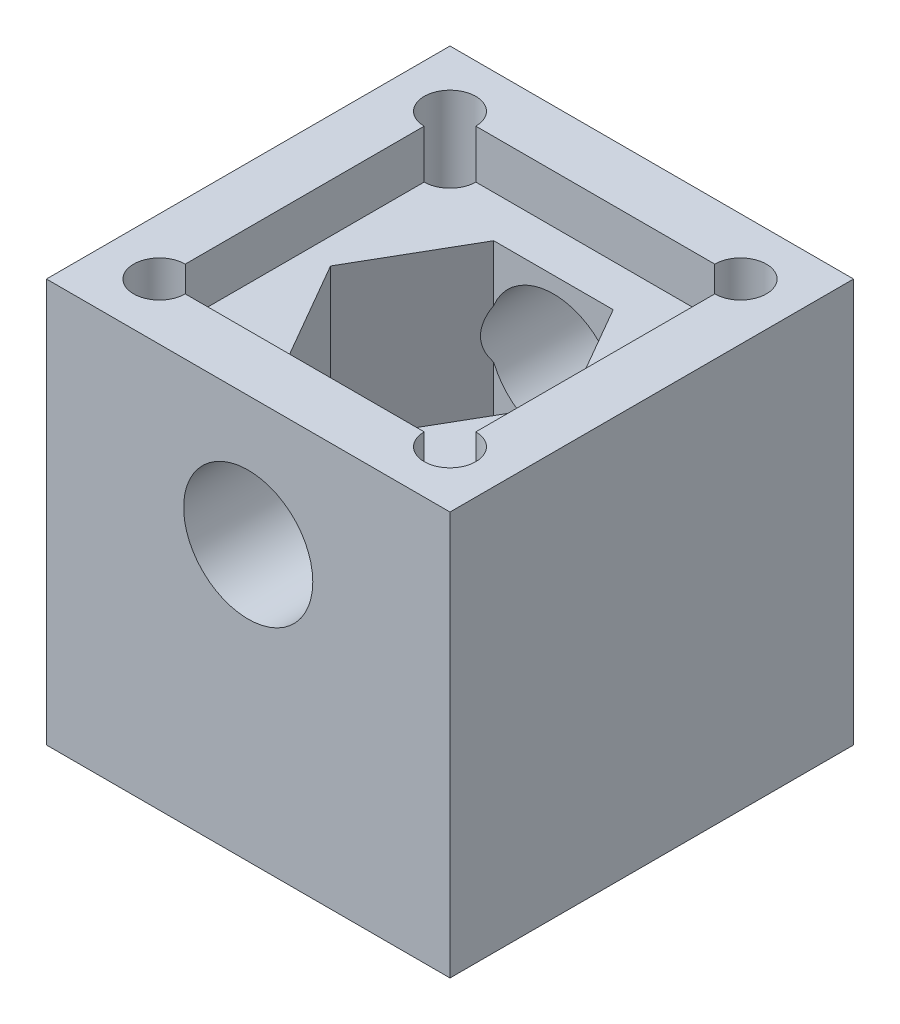
ISO-10303-21;
HEADER;
FILE_DESCRIPTION(('STEP AP214'),'2;1');
FILE_NAME('part.step','',(''),(''),'','','');
FILE_SCHEMA(('AUTOMOTIVE_DESIGN { 1 0 10303 214 1 1 1 1 }'));
ENDSEC;
DATA;
#1=APPLICATION_CONTEXT('core data for automotive mechanical design processes');
#2=APPLICATION_PROTOCOL_DEFINITION('international standard','automotive_design',2000,#1);
#3=PRODUCT_CONTEXT('',#1,'mechanical');
#4=PRODUCT('Part','Part','',(#3));
#5=PRODUCT_RELATED_PRODUCT_CATEGORY('part','',(#4));
#6=PRODUCT_DEFINITION_FORMATION('','',#4);
#7=PRODUCT_DEFINITION_CONTEXT('part definition',#1,'design');
#8=PRODUCT_DEFINITION('design','',#6,#7);
#9=PRODUCT_DEFINITION_SHAPE('','',#8);
#10=(LENGTH_UNIT() NAMED_UNIT(*) SI_UNIT(.MILLI.,.METRE.));
#11=(NAMED_UNIT(*) PLANE_ANGLE_UNIT() SI_UNIT($,.RADIAN.));
#12=(NAMED_UNIT(*) SI_UNIT($,.STERADIAN.) SOLID_ANGLE_UNIT());
#13=UNCERTAINTY_MEASURE_WITH_UNIT(LENGTH_MEASURE(1.E-05),#10,'distance_accuracy_value','');
#14=(GEOMETRIC_REPRESENTATION_CONTEXT(3) GLOBAL_UNCERTAINTY_ASSIGNED_CONTEXT((#13)) GLOBAL_UNIT_ASSIGNED_CONTEXT((#10,
#11,#12)) REPRESENTATION_CONTEXT('',''));
#15=CARTESIAN_POINT('',(0.,0.,0.));
#16=DIRECTION('',(0.,0.,1.));
#17=DIRECTION('',(1.,0.,0.));
#18=AXIS2_PLACEMENT_3D('',#15,#16,#17);
#19=CARTESIAN_POINT('',(-3.7,7.,-6.40858798800484));
#20=DIRECTION('',(-0.866025403784439,0.,-0.5));
#21=DIRECTION('',(-0.5,0.,0.866025403784439));
#22=AXIS2_PLACEMENT_3D('',#19,#20,#21);
#23=PLANE('',#22);
#24=DIRECTION('',(0.5,0.,-0.866025403784439));
#25=VECTOR('',#24,1.);
#26=CARTESIAN_POINT('',(-3.7,22.,-6.40858798800484));
#27=LINE('',#26,#25);
#28=CARTESIAN_POINT('',(-7.4,22.,0.));
#29=VERTEX_POINT('',#28);
#30=CARTESIAN_POINT('',(-3.7,22.,-6.40858798800484));
#31=VERTEX_POINT('',#30);
#32=EDGE_CURVE('E385',#29,#31,#27,.T.);
#33=ORIENTED_EDGE('',*,*,#32,.F.);
#34=DIRECTION('',(0.,1.,0.));
#35=VECTOR('',#34,1.);
#36=CARTESIAN_POINT('',(-7.4,7.,0.));
#37=LINE('',#36,#35);
#38=CARTESIAN_POINT('',(-7.4,7.,0.));
#39=VERTEX_POINT('',#38);
#40=EDGE_CURVE('E240',#39,#29,#37,.T.);
#41=ORIENTED_EDGE('',*,*,#40,.F.);
#42=DIRECTION('',(-0.5,0.,0.866025403784439));
#43=VECTOR('',#42,1.);
#44=CARTESIAN_POINT('',(-3.7,7.,-6.40858798800484));
#45=LINE('',#44,#43);
#46=CARTESIAN_POINT('',(-3.7,7.,-6.40858798800484));
#47=VERTEX_POINT('',#46);
#48=EDGE_CURVE('E236',#47,#39,#45,.T.);
#49=ORIENTED_EDGE('',*,*,#48,.F.);
#50=DIRECTION('',(0.,1.,0.));
#51=VECTOR('',#50,1.);
#52=CARTESIAN_POINT('',(-3.7,7.,-6.40858798800484));
#53=LINE('',#52,#51);
#54=CARTESIAN_POINT('',(-3.7,15.4801315846429,-6.40858798800484));
#55=VERTEX_POINT('',#54);
#56=EDGE_CURVE('E244',#47,#55,#53,.T.);
#57=ORIENTED_EDGE('',*,*,#56,.T.);
#58=CARTESIAN_POINT('',(0.,17.,-12.8171759760097));
#59=DIRECTION('',(-0.866025403784439,0.,-0.5));
#60=DIRECTION('',(-0.5,0.,0.866025403784439));
#61=AXIS2_PLACEMENT_3D('',#58,#59,#60);
#62=ELLIPSE('',#61,8.,4.);
#63=CARTESIAN_POINT('',(-3.7,18.5198684153571,-6.40858798800484));
#64=VERTEX_POINT('',#63);
#65=EDGE_CURVE('E269',#64,#55,#62,.F.);
#66=ORIENTED_EDGE('',*,*,#65,.F.);
#67=EDGE_CURVE('E247',#64,#31,#53,.T.);
#68=ORIENTED_EDGE('',*,*,#67,.T.);
#69=EDGE_LOOP('',(#33,#41,#49,#57,#66,#68));
#70=FACE_BOUND('',#69,.T.);
#71=ADVANCED_FACE('F35',(#70),#23,.F.);
#72=CARTESIAN_POINT('',(3.7,7.,-6.40858798800485));
#73=DIRECTION('',(0.,0.,-1.));
#74=DIRECTION('',(-1.,0.,0.));
#75=AXIS2_PLACEMENT_3D('',#72,#73,#74);
#76=PLANE('',#75);
#77=DIRECTION('',(1.,0.,0.));
#78=VECTOR('',#77,1.);
#79=CARTESIAN_POINT('',(3.7,22.,-6.40858798800485));
#80=LINE('',#79,#78);
#81=CARTESIAN_POINT('',(3.7,22.,-6.40858798800484));
#82=VERTEX_POINT('',#81);
#83=EDGE_CURVE('E383',#31,#82,#80,.T.);
#84=ORIENTED_EDGE('',*,*,#83,.F.);
#85=ORIENTED_EDGE('',*,*,#67,.F.);
#86=CARTESIAN_POINT('',(0.,17.,-6.40858798800485));
#87=DIRECTION('',(0.,0.,-1.));
#88=DIRECTION('',(-1.,0.,0.));
#89=AXIS2_PLACEMENT_3D('',#86,#87,#88);
#90=CIRCLE('',#89,4.);
#91=CARTESIAN_POINT('',(3.7,18.5198684153571,-6.40858798800485));
#92=VERTEX_POINT('',#91);
#93=EDGE_CURVE('E265',#92,#64,#90,.F.);
#94=ORIENTED_EDGE('',*,*,#93,.F.);
#95=DIRECTION('',(0.,1.,0.));
#96=VECTOR('',#95,1.);
#97=CARTESIAN_POINT('',(3.7,7.,-6.40858798800485));
#98=LINE('',#97,#96);
#99=EDGE_CURVE('E251',#92,#82,#98,.T.);
#100=ORIENTED_EDGE('',*,*,#99,.T.);
#101=EDGE_LOOP('',(#84,#85,#94,#100));
#102=FACE_BOUND('',#101,.T.);
#103=ADVANCED_FACE('F411',(#102),#76,.F.);
#104=CARTESIAN_POINT('',(7.4,7.,0.));
#105=DIRECTION('',(0.866025403784438,0.,-0.5));
#106=DIRECTION('',(-0.5,0.,-0.866025403784439));
#107=AXIS2_PLACEMENT_3D('',#104,#105,#106);
#108=PLANE('',#107);
#109=DIRECTION('',(0.5,0.,0.866025403784439));
#110=VECTOR('',#109,1.);
#111=CARTESIAN_POINT('',(7.4,22.,0.));
#112=LINE('',#111,#110);
#113=CARTESIAN_POINT('',(7.4,22.,0.));
#114=VERTEX_POINT('',#113);
#115=EDGE_CURVE('E381',#82,#114,#112,.T.);
#116=ORIENTED_EDGE('',*,*,#115,.F.);
#117=ORIENTED_EDGE('',*,*,#99,.F.);
#118=CARTESIAN_POINT('',(0.,17.,-12.8171759760097));
#119=DIRECTION('',(0.866025403784438,0.,-0.5));
#120=DIRECTION('',(0.5,0.,0.866025403784439));
#121=AXIS2_PLACEMENT_3D('',#118,#119,#120);
#122=ELLIPSE('',#121,8.,4.);
#123=CARTESIAN_POINT('',(3.7,15.4801315846429,-6.40858798800485));
#124=VERTEX_POINT('',#123);
#125=EDGE_CURVE('E262',#124,#92,#122,.F.);
#126=ORIENTED_EDGE('',*,*,#125,.F.);
#127=CARTESIAN_POINT('',(3.7,7.,-6.40858798800485));
#128=VERTEX_POINT('',#127);
#129=EDGE_CURVE('E248',#128,#124,#98,.T.);
#130=ORIENTED_EDGE('',*,*,#129,.F.);
#131=DIRECTION('',(-0.5,0.,-0.866025403784439));
#132=VECTOR('',#131,1.);
#133=CARTESIAN_POINT('',(7.4,7.,0.));
#134=LINE('',#133,#132);
#135=CARTESIAN_POINT('',(7.4,7.,0.));
#136=VERTEX_POINT('',#135);
#137=EDGE_CURVE('E230',#136,#128,#134,.T.);
#138=ORIENTED_EDGE('',*,*,#137,.F.);
#139=DIRECTION('',(0.,1.,0.));
#140=VECTOR('',#139,1.);
#141=CARTESIAN_POINT('',(7.4,7.,0.));
#142=LINE('',#141,#140);
#143=EDGE_CURVE('E252',#136,#114,#142,.T.);
#144=ORIENTED_EDGE('',*,*,#143,.T.);
#145=EDGE_LOOP('',(#116,#117,#126,#130,#138,#144));
#146=FACE_BOUND('',#145,.T.);
#147=ADVANCED_FACE('F417',(#146),#108,.F.);
#148=CARTESIAN_POINT('',(-7.4,7.,0.));
#149=DIRECTION('',(-0.866025403784438,0.,0.5));
#150=DIRECTION('',(0.5,0.,0.866025403784439));
#151=AXIS2_PLACEMENT_3D('',#148,#149,#150);
#152=PLANE('',#151);
#153=DIRECTION('',(-0.5,0.,-0.866025403784439));
#154=VECTOR('',#153,1.);
#155=CARTESIAN_POINT('',(-7.4,22.,0.));
#156=LINE('',#155,#154);
#157=CARTESIAN_POINT('',(-3.7,22.,6.40858798800485));
#158=VERTEX_POINT('',#157);
#159=EDGE_CURVE('E379',#158,#29,#156,.T.);
#160=ORIENTED_EDGE('',*,*,#159,.F.);
#161=DIRECTION('',(0.,1.,0.));
#162=VECTOR('',#161,1.);
#163=CARTESIAN_POINT('',(-3.7,7.,6.40858798800485));
#164=LINE('',#163,#162);
#165=CARTESIAN_POINT('',(-3.7,18.5198684153571,6.40858798800485));
#166=VERTEX_POINT('',#165);
#167=EDGE_CURVE('E239',#166,#158,#164,.T.);
#168=ORIENTED_EDGE('',*,*,#167,.F.);
#169=CARTESIAN_POINT('',(0.,17.,12.8171759760097));
#170=DIRECTION('',(-0.866025403784438,0.,0.5));
#171=DIRECTION('',(0.5,0.,0.866025403784439));
#172=AXIS2_PLACEMENT_3D('',#169,#170,#171);
#173=ELLIPSE('',#172,8.,4.);
#174=CARTESIAN_POINT('',(-3.7,15.4801315846429,6.40858798800485));
#175=VERTEX_POINT('',#174);
#176=EDGE_CURVE('E320',#175,#166,#173,.F.);
#177=ORIENTED_EDGE('',*,*,#176,.F.);
#178=CARTESIAN_POINT('',(-3.7,7.,6.40858798800485));
#179=VERTEX_POINT('',#178);
#180=EDGE_CURVE('E259',#179,#175,#164,.T.);
#181=ORIENTED_EDGE('',*,*,#180,.F.);
#182=DIRECTION('',(0.5,0.,0.866025403784439));
#183=VECTOR('',#182,1.);
#184=CARTESIAN_POINT('',(-7.4,7.,0.));
#185=LINE('',#184,#183);
#186=EDGE_CURVE('E215',#39,#179,#185,.T.);
#187=ORIENTED_EDGE('',*,*,#186,.F.);
#188=ORIENTED_EDGE('',*,*,#40,.T.);
#189=EDGE_LOOP('',(#160,#168,#177,#181,#187,#188));
#190=FACE_BOUND('',#189,.T.);
#191=ADVANCED_FACE('F432',(#190),#152,.F.);
#192=CARTESIAN_POINT('',(3.7,7.,6.40858798800485));
#193=DIRECTION('',(0.866025403784439,0.,0.5));
#194=DIRECTION('',(0.5,0.,-0.866025403784439));
#195=AXIS2_PLACEMENT_3D('',#192,#193,#194);
#196=PLANE('',#195);
#197=DIRECTION('',(-0.5,0.,0.866025403784439));
#198=VECTOR('',#197,1.);
#199=CARTESIAN_POINT('',(3.7,22.,6.40858798800485));
#200=LINE('',#199,#198);
#201=CARTESIAN_POINT('',(3.7,22.,6.40858798800485));
#202=VERTEX_POINT('',#201);
#203=EDGE_CURVE('E50',#114,#202,#200,.T.);
#204=ORIENTED_EDGE('',*,*,#203,.F.);
#205=ORIENTED_EDGE('',*,*,#143,.F.);
#206=DIRECTION('',(0.5,0.,-0.866025403784439));
#207=VECTOR('',#206,1.);
#208=CARTESIAN_POINT('',(3.7,7.,6.40858798800485));
#209=LINE('',#208,#207);
#210=CARTESIAN_POINT('',(3.7,7.,6.40858798800485));
#211=VERTEX_POINT('',#210);
#212=EDGE_CURVE('E227',#211,#136,#209,.T.);
#213=ORIENTED_EDGE('',*,*,#212,.F.);
#214=DIRECTION('',(0.,1.,0.));
#215=VECTOR('',#214,1.);
#216=CARTESIAN_POINT('',(3.7,7.,6.40858798800485));
#217=LINE('',#216,#215);
#218=CARTESIAN_POINT('',(3.7,15.4801315846429,6.40858798800485));
#219=VERTEX_POINT('',#218);
#220=EDGE_CURVE('E255',#211,#219,#217,.T.);
#221=ORIENTED_EDGE('',*,*,#220,.T.);
#222=CARTESIAN_POINT('',(0.,17.,12.8171759760097));
#223=DIRECTION('',(0.866025403784439,0.,0.5));
#224=DIRECTION('',(-0.5,0.,0.866025403784439));
#225=AXIS2_PLACEMENT_3D('',#222,#223,#224);
#226=ELLIPSE('',#225,8.00000000000001,4.);
#227=CARTESIAN_POINT('',(3.7,18.5198684153571,6.40858798800485));
#228=VERTEX_POINT('',#227);
#229=EDGE_CURVE('E316',#228,#219,#226,.F.);
#230=ORIENTED_EDGE('',*,*,#229,.F.);
#231=EDGE_CURVE('E258',#228,#202,#217,.T.);
#232=ORIENTED_EDGE('',*,*,#231,.T.);
#233=EDGE_LOOP('',(#204,#205,#213,#221,#230,#232));
#234=FACE_BOUND('',#233,.T.);
#235=ADVANCED_FACE('F434',(#234),#196,.F.);
#236=CARTESIAN_POINT('',(-3.7,7.,6.40858798800485));
#237=DIRECTION('',(0.,0.,1.));
#238=DIRECTION('',(1.,0.,0.));
#239=AXIS2_PLACEMENT_3D('',#236,#237,#238);
#240=PLANE('',#239);
#241=DIRECTION('',(-1.,0.,0.));
#242=VECTOR('',#241,1.);
#243=CARTESIAN_POINT('',(-3.7,22.,6.40858798800485));
#244=LINE('',#243,#242);
#245=EDGE_CURVE('E376',#202,#158,#244,.T.);
#246=ORIENTED_EDGE('',*,*,#245,.F.);
#247=ORIENTED_EDGE('',*,*,#231,.F.);
#248=CARTESIAN_POINT('',(0.,17.,6.40858798800485));
#249=DIRECTION('',(0.,0.,1.));
#250=DIRECTION('',(1.,0.,0.));
#251=AXIS2_PLACEMENT_3D('',#248,#249,#250);
#252=CIRCLE('',#251,4.);
#253=EDGE_CURVE('E311',#166,#228,#252,.F.);
#254=ORIENTED_EDGE('',*,*,#253,.F.);
#255=ORIENTED_EDGE('',*,*,#167,.T.);
#256=EDGE_LOOP('',(#246,#247,#254,#255));
#257=FACE_BOUND('',#256,.T.);
#258=ADVANCED_FACE('F437',(#257),#240,.F.);
#259=CARTESIAN_POINT('',(0.,0.,0.));
#260=DIRECTION('',(0.,1.,0.));
#261=DIRECTION('',(0.,0.,1.));
#262=AXIS2_PLACEMENT_3D('',#259,#260,#261);
#263=CYLINDRICAL_SURFACE('',#262,4.15);
#264=CARTESIAN_POINT('',(0.,0.,0.));
#265=DIRECTION('',(0.,1.,0.));
#266=DIRECTION('',(0.,0.,1.));
#267=AXIS2_PLACEMENT_3D('',#264,#265,#266);
#268=CIRCLE('',#267,4.15);
#269=CARTESIAN_POINT('',(0.,0.,4.15));
#270=VERTEX_POINT('',#269);
#271=EDGE_CURVE('E272',#270,#270,#268,.T.);
#272=ORIENTED_EDGE('',*,*,#271,.F.);
#273=EDGE_LOOP('',(#272));
#274=FACE_BOUND('',#273,.T.);
#275=CARTESIAN_POINT('',(0.,7.,0.));
#276=DIRECTION('',(0.,1.,0.));
#277=DIRECTION('',(0.,0.,1.));
#278=AXIS2_PLACEMENT_3D('',#275,#276,#277);
#279=CIRCLE('',#278,4.15);
#280=CARTESIAN_POINT('',(0.,7.,4.15));
#281=VERTEX_POINT('',#280);
#282=EDGE_CURVE('E243',#281,#281,#279,.F.);
#283=ORIENTED_EDGE('',*,*,#282,.F.);
#284=EDGE_LOOP('',(#283));
#285=FACE_BOUND('',#284,.T.);
#286=ADVANCED_FACE('F445',(#274,#285),#263,.F.);
#287=CARTESIAN_POINT('',(0.,17.,-12.5));
#288=DIRECTION('',(0.,0.,1.));
#289=DIRECTION('',(1.,0.,0.));
#290=AXIS2_PLACEMENT_3D('',#287,#288,#289);
#291=CYLINDRICAL_SURFACE('',#290,4.);
#292=ORIENTED_EDGE('',*,*,#93,.T.);
#293=ORIENTED_EDGE('',*,*,#65,.T.);
#294=EDGE_CURVE('E268',#55,#124,#90,.F.);
#295=ORIENTED_EDGE('',*,*,#294,.T.);
#296=ORIENTED_EDGE('',*,*,#125,.T.);
#297=EDGE_LOOP('',(#292,#293,#295,#296));
#298=FACE_BOUND('',#297,.T.);
#299=CARTESIAN_POINT('',(0.,17.,-12.5));
#300=DIRECTION('',(0.,0.,1.));
#301=DIRECTION('',(1.,0.,0.));
#302=AXIS2_PLACEMENT_3D('',#299,#300,#301);
#303=CIRCLE('',#302,4.);
#304=CARTESIAN_POINT('',(4.,17.,-12.5));
#305=VERTEX_POINT('',#304);
#306=EDGE_CURVE('E276',#305,#305,#303,.T.);
#307=ORIENTED_EDGE('',*,*,#306,.F.);
#308=EDGE_LOOP('',(#307));
#309=FACE_BOUND('',#308,.T.);
#310=ADVANCED_FACE('F448',(#298,#309),#291,.F.);
#311=CARTESIAN_POINT('',(-12.5,25.,12.5));
#312=DIRECTION('',(1.,0.,0.));
#313=DIRECTION('',(0.,0.,-1.));
#314=AXIS2_PLACEMENT_3D('',#311,#312,#313);
#315=PLANE('',#314);
#316=DIRECTION('',(0.,0.,1.));
#317=VECTOR('',#316,1.);
#318=CARTESIAN_POINT('',(-12.5,0.,12.5));
#319=LINE('',#318,#317);
#320=CARTESIAN_POINT('',(-12.5,0.,-12.5));
#321=VERTEX_POINT('',#320);
#322=CARTESIAN_POINT('',(-12.5,0.,12.5));
#323=VERTEX_POINT('',#322);
#324=EDGE_CURVE('E279',#321,#323,#319,.T.);
#325=ORIENTED_EDGE('',*,*,#324,.T.);
#326=DIRECTION('',(0.,-1.,0.));
#327=VECTOR('',#326,1.);
#328=CARTESIAN_POINT('',(-12.5,25.,12.5));
#329=LINE('',#328,#327);
#330=CARTESIAN_POINT('',(-12.5,25.,12.5));
#331=VERTEX_POINT('',#330);
#332=EDGE_CURVE('E308',#331,#323,#329,.T.);
#333=ORIENTED_EDGE('',*,*,#332,.F.);
#334=DIRECTION('',(0.,0.,1.));
#335=VECTOR('',#334,1.);
#336=CARTESIAN_POINT('',(-12.5,25.,12.5));
#337=LINE('',#336,#335);
#338=CARTESIAN_POINT('',(-12.5,25.,-12.5));
#339=VERTEX_POINT('',#338);
#340=EDGE_CURVE('E282',#339,#331,#337,.T.);
#341=ORIENTED_EDGE('',*,*,#340,.F.);
#342=DIRECTION('',(0.,-1.,0.));
#343=VECTOR('',#342,1.);
#344=CARTESIAN_POINT('',(-12.5,25.,-12.5));
#345=LINE('',#344,#343);
#346=EDGE_CURVE('E292',#339,#321,#345,.T.);
#347=ORIENTED_EDGE('',*,*,#346,.T.);
#348=EDGE_LOOP('',(#325,#333,#341,#347));
#349=FACE_BOUND('',#348,.T.);
#350=ADVANCED_FACE('F37',(#349),#315,.F.);
#351=CARTESIAN_POINT('',(12.5,25.,12.5));
#352=DIRECTION('',(0.,0.,-1.));
#353=DIRECTION('',(-1.,0.,0.));
#354=AXIS2_PLACEMENT_3D('',#351,#352,#353);
#355=PLANE('',#354);
#356=CARTESIAN_POINT('',(0.,17.,12.5));
#357=DIRECTION('',(0.,0.,1.));
#358=DIRECTION('',(1.,0.,0.));
#359=AXIS2_PLACEMENT_3D('',#356,#357,#358);
#360=CIRCLE('',#359,4.);
#361=CARTESIAN_POINT('',(4.,17.,12.5));
#362=VERTEX_POINT('',#361);
#363=EDGE_CURVE('E275',#362,#362,#360,.T.);
#364=ORIENTED_EDGE('',*,*,#363,.F.);
#365=EDGE_LOOP('',(#364));
#366=FACE_BOUND('',#365,.T.);
#367=DIRECTION('',(1.,0.,0.));
#368=VECTOR('',#367,1.);
#369=CARTESIAN_POINT('',(12.5,0.,12.5));
#370=LINE('',#369,#368);
#371=CARTESIAN_POINT('',(12.5,0.,12.5));
#372=VERTEX_POINT('',#371);
#373=EDGE_CURVE('E295',#323,#372,#370,.T.);
#374=ORIENTED_EDGE('',*,*,#373,.T.);
#375=DIRECTION('',(0.,-1.,0.));
#376=VECTOR('',#375,1.);
#377=CARTESIAN_POINT('',(12.5,25.,12.5));
#378=LINE('',#377,#376);
#379=CARTESIAN_POINT('',(12.5,25.,12.5));
#380=VERTEX_POINT('',#379);
#381=EDGE_CURVE('E305',#380,#372,#378,.T.);
#382=ORIENTED_EDGE('',*,*,#381,.F.);
#383=DIRECTION('',(1.,0.,0.));
#384=VECTOR('',#383,1.);
#385=CARTESIAN_POINT('',(12.5,25.,12.5));
#386=LINE('',#385,#384);
#387=EDGE_CURVE('E285',#331,#380,#386,.T.);
#388=ORIENTED_EDGE('',*,*,#387,.F.);
#389=ORIENTED_EDGE('',*,*,#332,.T.);
#390=EDGE_LOOP('',(#374,#382,#388,#389));
#391=FACE_BOUND('',#390,.T.);
#392=ADVANCED_FACE('F465',(#366,#391),#355,.F.);
#393=CARTESIAN_POINT('',(12.5,25.,12.5));
#394=DIRECTION('',(-1.,0.,0.));
#395=DIRECTION('',(0.,0.,1.));
#396=AXIS2_PLACEMENT_3D('',#393,#394,#395);
#397=PLANE('',#396);
#398=DIRECTION('',(0.,0.,-1.));
#399=VECTOR('',#398,1.);
#400=CARTESIAN_POINT('',(12.5,0.,12.5));
#401=LINE('',#400,#399);
#402=CARTESIAN_POINT('',(12.5,0.,-12.5));
#403=VERTEX_POINT('',#402);
#404=EDGE_CURVE('E297',#372,#403,#401,.T.);
#405=ORIENTED_EDGE('',*,*,#404,.T.);
#406=DIRECTION('',(0.,-1.,0.));
#407=VECTOR('',#406,1.);
#408=CARTESIAN_POINT('',(12.5,25.,-12.5));
#409=LINE('',#408,#407);
#410=CARTESIAN_POINT('',(12.5,25.,-12.5));
#411=VERTEX_POINT('',#410);
#412=EDGE_CURVE('E302',#411,#403,#409,.T.);
#413=ORIENTED_EDGE('',*,*,#412,.F.);
#414=DIRECTION('',(0.,0.,-1.));
#415=VECTOR('',#414,1.);
#416=CARTESIAN_POINT('',(12.5,25.,12.5));
#417=LINE('',#416,#415);
#418=EDGE_CURVE('E288',#380,#411,#417,.T.);
#419=ORIENTED_EDGE('',*,*,#418,.F.);
#420=ORIENTED_EDGE('',*,*,#381,.T.);
#421=EDGE_LOOP('',(#405,#413,#419,#420));
#422=FACE_BOUND('',#421,.T.);
#423=ADVANCED_FACE('F462',(#422),#397,.F.);
#424=CARTESIAN_POINT('',(12.5,25.,-12.5));
#425=DIRECTION('',(0.,0.,1.));
#426=DIRECTION('',(1.,0.,0.));
#427=AXIS2_PLACEMENT_3D('',#424,#425,#426);
#428=PLANE('',#427);
#429=ORIENTED_EDGE('',*,*,#306,.T.);
#430=EDGE_LOOP('',(#429));
#431=FACE_BOUND('',#430,.T.);
#432=DIRECTION('',(-1.,0.,0.));
#433=VECTOR('',#432,1.);
#434=CARTESIAN_POINT('',(12.5,0.,-12.5));
#435=LINE('',#434,#433);
#436=EDGE_CURVE('E286',#403,#321,#435,.T.);
#437=ORIENTED_EDGE('',*,*,#436,.T.);
#438=ORIENTED_EDGE('',*,*,#346,.F.);
#439=DIRECTION('',(-1.,0.,0.));
#440=VECTOR('',#439,1.);
#441=CARTESIAN_POINT('',(12.5,25.,-12.5));
#442=LINE('',#441,#440);
#443=EDGE_CURVE('E290',#411,#339,#442,.T.);
#444=ORIENTED_EDGE('',*,*,#443,.F.);
#445=ORIENTED_EDGE('',*,*,#412,.T.);
#446=EDGE_LOOP('',(#437,#438,#444,#445));
#447=FACE_BOUND('',#446,.T.);
#448=ADVANCED_FACE('F456',(#431,#447),#428,.F.);
#449=CARTESIAN_POINT('',(0.,25.,0.));
#450=DIRECTION('',(0.,1.,0.));
#451=DIRECTION('',(0.,0.,1.));
#452=AXIS2_PLACEMENT_3D('',#449,#450,#451);
#453=PLANE('',#452);
#454=DIRECTION('',(0.,0.,-1.));
#455=VECTOR('',#454,1.);
#456=CARTESIAN_POINT('',(9.,25.,-9.));
#457=LINE('',#456,#455);
#458=CARTESIAN_POINT('',(9.,25.,7.4));
#459=VERTEX_POINT('',#458);
#460=CARTESIAN_POINT('',(9.,25.,-7.4));
#461=VERTEX_POINT('',#460);
#462=EDGE_CURVE('E187',#459,#461,#457,.T.);
#463=ORIENTED_EDGE('',*,*,#462,.F.);
#464=CARTESIAN_POINT('',(9.,25.,9.));
#465=DIRECTION('',(0.,1.,0.));
#466=DIRECTION('',(0.,0.,1.));
#467=AXIS2_PLACEMENT_3D('',#464,#465,#466);
#468=CIRCLE('',#467,1.6);
#469=CARTESIAN_POINT('',(7.4,25.,9.));
#470=VERTEX_POINT('',#469);
#471=EDGE_CURVE('E202',#470,#459,#468,.T.);
#472=ORIENTED_EDGE('',*,*,#471,.F.);
#473=DIRECTION('',(1.,0.,0.));
#474=VECTOR('',#473,1.);
#475=CARTESIAN_POINT('',(-9.,25.,9.));
#476=LINE('',#475,#474);
#477=CARTESIAN_POINT('',(-7.4,25.,9.));
#478=VERTEX_POINT('',#477);
#479=EDGE_CURVE('E363',#478,#470,#476,.T.);
#480=ORIENTED_EDGE('',*,*,#479,.F.);
#481=CARTESIAN_POINT('',(-9.,25.,9.));
#482=DIRECTION('',(0.,1.,0.));
#483=DIRECTION('',(0.,0.,1.));
#484=AXIS2_PLACEMENT_3D('',#481,#482,#483);
#485=CIRCLE('',#484,1.6);
#486=CARTESIAN_POINT('',(-9.,25.,7.4));
#487=VERTEX_POINT('',#486);
#488=EDGE_CURVE('E218',#487,#478,#485,.T.);
#489=ORIENTED_EDGE('',*,*,#488,.F.);
#490=DIRECTION('',(0.,0.,1.));
#491=VECTOR('',#490,1.);
#492=CARTESIAN_POINT('',(-9.,25.,-9.));
#493=LINE('',#492,#491);
#494=CARTESIAN_POINT('',(-9.,25.,-7.4));
#495=VERTEX_POINT('',#494);
#496=EDGE_CURVE('E345',#495,#487,#493,.T.);
#497=ORIENTED_EDGE('',*,*,#496,.F.);
#498=CARTESIAN_POINT('',(-9.,25.,-9.));
#499=DIRECTION('',(0.,1.,0.));
#500=DIRECTION('',(0.,0.,1.));
#501=AXIS2_PLACEMENT_3D('',#498,#499,#500);
#502=CIRCLE('',#501,1.6);
#503=CARTESIAN_POINT('',(-7.4,25.,-9.));
#504=VERTEX_POINT('',#503);
#505=EDGE_CURVE('E338',#504,#495,#502,.T.);
#506=ORIENTED_EDGE('',*,*,#505,.F.);
#507=DIRECTION('',(-1.,0.,0.));
#508=VECTOR('',#507,1.);
#509=CARTESIAN_POINT('',(-9.,25.,-9.));
#510=LINE('',#509,#508);
#511=CARTESIAN_POINT('',(7.4,25.,-9.));
#512=VERTEX_POINT('',#511);
#513=EDGE_CURVE('E205',#512,#504,#510,.T.);
#514=ORIENTED_EDGE('',*,*,#513,.F.);
#515=CARTESIAN_POINT('',(9.,25.,-9.));
#516=DIRECTION('',(0.,1.,0.));
#517=DIRECTION('',(0.,0.,1.));
#518=AXIS2_PLACEMENT_3D('',#515,#516,#517);
#519=CIRCLE('',#518,1.6);
#520=EDGE_CURVE('E193',#461,#512,#519,.T.);
#521=ORIENTED_EDGE('',*,*,#520,.F.);
#522=EDGE_LOOP('',(#463,#472,#480,#489,#497,#506,#514,#521));
#523=FACE_BOUND('',#522,.T.);
#524=ORIENTED_EDGE('',*,*,#340,.T.);
#525=ORIENTED_EDGE('',*,*,#387,.T.);
#526=ORIENTED_EDGE('',*,*,#418,.T.);
#527=ORIENTED_EDGE('',*,*,#443,.T.);
#528=EDGE_LOOP('',(#524,#525,#526,#527));
#529=FACE_BOUND('',#528,.T.);
#530=ADVANCED_FACE('F199',(#523,#529),#453,.T.);
#531=CARTESIAN_POINT('',(0.,0.,0.));
#532=DIRECTION('',(0.,1.,0.));
#533=DIRECTION('',(0.,0.,1.));
#534=AXIS2_PLACEMENT_3D('',#531,#532,#533);
#535=PLANE('',#534);
#536=CARTESIAN_POINT('',(-9.,0.,9.));
#537=DIRECTION('',(0.,1.,0.));
#538=DIRECTION('',(0.,0.,1.));
#539=AXIS2_PLACEMENT_3D('',#536,#537,#538);
#540=CIRCLE('',#539,1.6);
#541=CARTESIAN_POINT('',(-9.,0.,10.6));
#542=VERTEX_POINT('',#541);
#543=EDGE_CURVE('E212',#542,#542,#540,.T.);
#544=ORIENTED_EDGE('',*,*,#543,.T.);
#545=EDGE_LOOP('',(#544));
#546=FACE_BOUND('',#545,.T.);
#547=CARTESIAN_POINT('',(-9.,0.,-9.));
#548=DIRECTION('',(0.,1.,0.));
#549=DIRECTION('',(0.,0.,1.));
#550=AXIS2_PLACEMENT_3D('',#547,#548,#549);
#551=CIRCLE('',#550,1.6);
#552=CARTESIAN_POINT('',(-9.,0.,-7.4));
#553=VERTEX_POINT('',#552);
#554=EDGE_CURVE('E346',#553,#553,#551,.T.);
#555=ORIENTED_EDGE('',*,*,#554,.T.);
#556=EDGE_LOOP('',(#555));
#557=FACE_BOUND('',#556,.T.);
#558=CARTESIAN_POINT('',(9.,0.,-9.));
#559=DIRECTION('',(0.,1.,0.));
#560=DIRECTION('',(0.,0.,1.));
#561=AXIS2_PLACEMENT_3D('',#558,#559,#560);
#562=CIRCLE('',#561,1.6);
#563=CARTESIAN_POINT('',(9.,0.,-7.4));
#564=VERTEX_POINT('',#563);
#565=EDGE_CURVE('E347',#564,#564,#562,.T.);
#566=ORIENTED_EDGE('',*,*,#565,.T.);
#567=EDGE_LOOP('',(#566));
#568=FACE_BOUND('',#567,.T.);
#569=CARTESIAN_POINT('',(9.,0.,9.));
#570=DIRECTION('',(0.,1.,0.));
#571=DIRECTION('',(0.,0.,1.));
#572=AXIS2_PLACEMENT_3D('',#569,#570,#571);
#573=CIRCLE('',#572,1.6);
#574=CARTESIAN_POINT('',(9.,0.,10.6));
#575=VERTEX_POINT('',#574);
#576=EDGE_CURVE('E211',#575,#575,#573,.T.);
#577=ORIENTED_EDGE('',*,*,#576,.T.);
#578=EDGE_LOOP('',(#577));
#579=FACE_BOUND('',#578,.T.);
#580=ORIENTED_EDGE('',*,*,#271,.T.);
#581=EDGE_LOOP('',(#580));
#582=FACE_BOUND('',#581,.T.);
#583=ORIENTED_EDGE('',*,*,#324,.F.);
#584=ORIENTED_EDGE('',*,*,#436,.F.);
#585=ORIENTED_EDGE('',*,*,#404,.F.);
#586=ORIENTED_EDGE('',*,*,#373,.F.);
#587=EDGE_LOOP('',(#583,#584,#585,#586));
#588=FACE_BOUND('',#587,.T.);
#589=ADVANCED_FACE('F452',(#546,#557,#568,#579,#582,#588),#535,.F.);
#590=ORIENTED_EDGE('',*,*,#229,.T.);
#591=EDGE_CURVE('E317',#219,#175,#252,.F.);
#592=ORIENTED_EDGE('',*,*,#591,.T.);
#593=ORIENTED_EDGE('',*,*,#176,.T.);
#594=ORIENTED_EDGE('',*,*,#253,.T.);
#595=EDGE_LOOP('',(#590,#592,#593,#594));
#596=FACE_BOUND('',#595,.T.);
#597=ORIENTED_EDGE('',*,*,#363,.T.);
#598=EDGE_LOOP('',(#597));
#599=FACE_BOUND('',#598,.T.);
#600=ADVANCED_FACE('F428',(#596,#599),#291,.F.);
#601=ORIENTED_EDGE('',*,*,#56,.F.);
#602=DIRECTION('',(-1.,0.,0.));
#603=VECTOR('',#602,1.);
#604=CARTESIAN_POINT('',(3.7,7.,-6.40858798800485));
#605=LINE('',#604,#603);
#606=EDGE_CURVE('E233',#128,#47,#605,.T.);
#607=ORIENTED_EDGE('',*,*,#606,.F.);
#608=ORIENTED_EDGE('',*,*,#129,.T.);
#609=ORIENTED_EDGE('',*,*,#294,.F.);
#610=EDGE_LOOP('',(#601,#607,#608,#609));
#611=FACE_BOUND('',#610,.T.);
#612=ADVANCED_FACE('F420',(#611),#76,.F.);
#613=ORIENTED_EDGE('',*,*,#220,.F.);
#614=DIRECTION('',(1.,0.,0.));
#615=VECTOR('',#614,1.);
#616=CARTESIAN_POINT('',(-3.7,7.,6.40858798800485));
#617=LINE('',#616,#615);
#618=EDGE_CURVE('E224',#179,#211,#617,.T.);
#619=ORIENTED_EDGE('',*,*,#618,.F.);
#620=ORIENTED_EDGE('',*,*,#180,.T.);
#621=ORIENTED_EDGE('',*,*,#591,.F.);
#622=EDGE_LOOP('',(#613,#619,#620,#621));
#623=FACE_BOUND('',#622,.T.);
#624=ADVANCED_FACE('F427',(#623),#240,.F.);
#625=CARTESIAN_POINT('',(0.,7.,0.));
#626=DIRECTION('',(0.,1.,0.));
#627=DIRECTION('',(0.,0.,1.));
#628=AXIS2_PLACEMENT_3D('',#625,#626,#627);
#629=PLANE('',#628);
#630=ORIENTED_EDGE('',*,*,#186,.T.);
#631=ORIENTED_EDGE('',*,*,#618,.T.);
#632=ORIENTED_EDGE('',*,*,#212,.T.);
#633=ORIENTED_EDGE('',*,*,#137,.T.);
#634=ORIENTED_EDGE('',*,*,#606,.T.);
#635=ORIENTED_EDGE('',*,*,#48,.T.);
#636=EDGE_LOOP('',(#630,#631,#632,#633,#634,#635));
#637=FACE_BOUND('',#636,.T.);
#638=ORIENTED_EDGE('',*,*,#282,.T.);
#639=EDGE_LOOP('',(#638));
#640=FACE_BOUND('',#639,.T.);
#641=ADVANCED_FACE('F423',(#637,#640),#629,.T.);
#642=CARTESIAN_POINT('',(9.,0.,9.));
#643=DIRECTION('',(0.,1.,0.));
#644=DIRECTION('',(0.,0.,1.));
#645=AXIS2_PLACEMENT_3D('',#642,#643,#644);
#646=CYLINDRICAL_SURFACE('',#645,1.6);
#647=ORIENTED_EDGE('',*,*,#471,.T.);
#648=DIRECTION('',(0.,1.,0.));
#649=VECTOR('',#648,1.);
#650=CARTESIAN_POINT('',(9.,0.,7.4));
#651=LINE('',#650,#649);
#652=CARTESIAN_POINT('',(9.,22.,7.4));
#653=VERTEX_POINT('',#652);
#654=EDGE_CURVE('E184',#459,#653,#651,.F.);
#655=ORIENTED_EDGE('',*,*,#654,.T.);
#656=CARTESIAN_POINT('',(9.,22.,9.));
#657=DIRECTION('',(0.,1.,0.));
#658=DIRECTION('',(0.,0.,1.));
#659=AXIS2_PLACEMENT_3D('',#656,#657,#658);
#660=CIRCLE('',#659,1.6);
#661=CARTESIAN_POINT('',(7.4,22.,9.));
#662=VERTEX_POINT('',#661);
#663=EDGE_CURVE('E361',#662,#653,#660,.F.);
#664=ORIENTED_EDGE('',*,*,#663,.F.);
#665=DIRECTION('',(0.,1.,0.));
#666=VECTOR('',#665,1.);
#667=CARTESIAN_POINT('',(7.4,0.,9.));
#668=LINE('',#667,#666);
#669=EDGE_CURVE('E210',#662,#470,#668,.T.);
#670=ORIENTED_EDGE('',*,*,#669,.T.);
#671=EDGE_LOOP('',(#647,#655,#664,#670));
#672=FACE_BOUND('',#671,.T.);
#673=ORIENTED_EDGE('',*,*,#576,.F.);
#674=EDGE_LOOP('',(#673));
#675=FACE_BOUND('',#674,.T.);
#676=ADVANCED_FACE('F208',(#672,#675),#646,.F.);
#677=CARTESIAN_POINT('',(9.,0.,-9.));
#678=DIRECTION('',(0.,1.,0.));
#679=DIRECTION('',(0.,0.,1.));
#680=AXIS2_PLACEMENT_3D('',#677,#678,#679);
#681=CYLINDRICAL_SURFACE('',#680,1.6);
#682=ORIENTED_EDGE('',*,*,#565,.F.);
#683=EDGE_LOOP('',(#682));
#684=FACE_BOUND('',#683,.T.);
#685=CARTESIAN_POINT('',(9.,22.,-9.));
#686=DIRECTION('',(0.,1.,0.));
#687=DIRECTION('',(0.,0.,1.));
#688=AXIS2_PLACEMENT_3D('',#685,#686,#687);
#689=CIRCLE('',#688,1.6);
#690=CARTESIAN_POINT('',(9.,22.,-7.4));
#691=VERTEX_POINT('',#690);
#692=CARTESIAN_POINT('',(7.4,22.,-9.));
#693=VERTEX_POINT('',#692);
#694=EDGE_CURVE('E358',#691,#693,#689,.F.);
#695=ORIENTED_EDGE('',*,*,#694,.F.);
#696=DIRECTION('',(0.,1.,0.));
#697=VECTOR('',#696,1.);
#698=CARTESIAN_POINT('',(9.,0.,-7.4));
#699=LINE('',#698,#697);
#700=EDGE_CURVE('E11',#691,#461,#699,.T.);
#701=ORIENTED_EDGE('',*,*,#700,.T.);
#702=ORIENTED_EDGE('',*,*,#520,.T.);
#703=DIRECTION('',(0.,1.,0.));
#704=VECTOR('',#703,1.);
#705=CARTESIAN_POINT('',(7.4,0.,-9.));
#706=LINE('',#705,#704);
#707=EDGE_CURVE('E194',#512,#693,#706,.F.);
#708=ORIENTED_EDGE('',*,*,#707,.T.);
#709=EDGE_LOOP('',(#695,#701,#702,#708));
#710=FACE_BOUND('',#709,.T.);
#711=ADVANCED_FACE('F357',(#684,#710),#681,.F.);
#712=CARTESIAN_POINT('',(-9.,0.,-9.));
#713=DIRECTION('',(0.,1.,0.));
#714=DIRECTION('',(0.,0.,1.));
#715=AXIS2_PLACEMENT_3D('',#712,#713,#714);
#716=CYLINDRICAL_SURFACE('',#715,1.6);
#717=ORIENTED_EDGE('',*,*,#505,.T.);
#718=DIRECTION('',(0.,1.,0.));
#719=VECTOR('',#718,1.);
#720=CARTESIAN_POINT('',(-9.,0.,-7.4));
#721=LINE('',#720,#719);
#722=CARTESIAN_POINT('',(-9.,22.,-7.4));
#723=VERTEX_POINT('',#722);
#724=EDGE_CURVE('E387',#495,#723,#721,.F.);
#725=ORIENTED_EDGE('',*,*,#724,.T.);
#726=CARTESIAN_POINT('',(-9.,22.,-9.));
#727=DIRECTION('',(0.,1.,0.));
#728=DIRECTION('',(0.,0.,1.));
#729=AXIS2_PLACEMENT_3D('',#726,#727,#728);
#730=CIRCLE('',#729,1.6);
#731=CARTESIAN_POINT('',(-7.4,22.,-9.));
#732=VERTEX_POINT('',#731);
#733=EDGE_CURVE('E339',#732,#723,#730,.F.);
#734=ORIENTED_EDGE('',*,*,#733,.F.);
#735=DIRECTION('',(0.,1.,0.));
#736=VECTOR('',#735,1.);
#737=CARTESIAN_POINT('',(-7.4,0.,-9.));
#738=LINE('',#737,#736);
#739=EDGE_CURVE('E43',#732,#504,#738,.T.);
#740=ORIENTED_EDGE('',*,*,#739,.T.);
#741=EDGE_LOOP('',(#717,#725,#734,#740));
#742=FACE_BOUND('',#741,.T.);
#743=ORIENTED_EDGE('',*,*,#554,.F.);
#744=EDGE_LOOP('',(#743));
#745=FACE_BOUND('',#744,.T.);
#746=ADVANCED_FACE('F335',(#742,#745),#716,.F.);
#747=CARTESIAN_POINT('',(-9.,0.,9.));
#748=DIRECTION('',(0.,1.,0.));
#749=DIRECTION('',(0.,0.,1.));
#750=AXIS2_PLACEMENT_3D('',#747,#748,#749);
#751=CYLINDRICAL_SURFACE('',#750,1.6);
#752=ORIENTED_EDGE('',*,*,#488,.T.);
#753=DIRECTION('',(0.,1.,0.));
#754=VECTOR('',#753,1.);
#755=CARTESIAN_POINT('',(-7.4,0.,9.));
#756=LINE('',#755,#754);
#757=CARTESIAN_POINT('',(-7.4,22.,9.));
#758=VERTEX_POINT('',#757);
#759=EDGE_CURVE('E328',#478,#758,#756,.F.);
#760=ORIENTED_EDGE('',*,*,#759,.T.);
#761=CARTESIAN_POINT('',(-9.,22.,9.));
#762=DIRECTION('',(0.,1.,0.));
#763=DIRECTION('',(0.,0.,1.));
#764=AXIS2_PLACEMENT_3D('',#761,#762,#763);
#765=CIRCLE('',#764,1.6);
#766=CARTESIAN_POINT('',(-9.,22.,7.4));
#767=VERTEX_POINT('',#766);
#768=EDGE_CURVE('E323',#767,#758,#765,.F.);
#769=ORIENTED_EDGE('',*,*,#768,.F.);
#770=DIRECTION('',(0.,1.,0.));
#771=VECTOR('',#770,1.);
#772=CARTESIAN_POINT('',(-9.,0.,7.4));
#773=LINE('',#772,#771);
#774=EDGE_CURVE('E325',#767,#487,#773,.T.);
#775=ORIENTED_EDGE('',*,*,#774,.T.);
#776=EDGE_LOOP('',(#752,#760,#769,#775));
#777=FACE_BOUND('',#776,.T.);
#778=ORIENTED_EDGE('',*,*,#543,.F.);
#779=EDGE_LOOP('',(#778));
#780=FACE_BOUND('',#779,.T.);
#781=ADVANCED_FACE('F392',(#777,#780),#751,.F.);
#782=CARTESIAN_POINT('',(9.,22.,-9.));
#783=DIRECTION('',(1.,0.,0.));
#784=DIRECTION('',(0.,0.,-1.));
#785=AXIS2_PLACEMENT_3D('',#782,#783,#784);
#786=PLANE('',#785);
#787=ORIENTED_EDGE('',*,*,#462,.T.);
#788=ORIENTED_EDGE('',*,*,#700,.F.);
#789=DIRECTION('',(0.,0.,-1.));
#790=VECTOR('',#789,1.);
#791=CARTESIAN_POINT('',(9.,22.,-9.));
#792=LINE('',#791,#790);
#793=EDGE_CURVE('E189',#653,#691,#792,.T.);
#794=ORIENTED_EDGE('',*,*,#793,.F.);
#795=ORIENTED_EDGE('',*,*,#654,.F.);
#796=EDGE_LOOP('',(#787,#788,#794,#795));
#797=FACE_BOUND('',#796,.T.);
#798=ADVANCED_FACE('F186',(#797),#786,.F.);
#799=CARTESIAN_POINT('',(-9.,22.,-9.));
#800=DIRECTION('',(0.,0.,-1.));
#801=DIRECTION('',(-1.,0.,0.));
#802=AXIS2_PLACEMENT_3D('',#799,#800,#801);
#803=PLANE('',#802);
#804=ORIENTED_EDGE('',*,*,#513,.T.);
#805=ORIENTED_EDGE('',*,*,#739,.F.);
#806=DIRECTION('',(-1.,0.,0.));
#807=VECTOR('',#806,1.);
#808=CARTESIAN_POINT('',(-9.,22.,-9.));
#809=LINE('',#808,#807);
#810=EDGE_CURVE('E362',#693,#732,#809,.T.);
#811=ORIENTED_EDGE('',*,*,#810,.F.);
#812=ORIENTED_EDGE('',*,*,#707,.F.);
#813=EDGE_LOOP('',(#804,#805,#811,#812));
#814=FACE_BOUND('',#813,.T.);
#815=ADVANCED_FACE('F400',(#814),#803,.F.);
#816=CARTESIAN_POINT('',(-9.,22.,9.));
#817=DIRECTION('',(0.,0.,1.));
#818=DIRECTION('',(1.,0.,0.));
#819=AXIS2_PLACEMENT_3D('',#816,#817,#818);
#820=PLANE('',#819);
#821=DIRECTION('',(1.,0.,0.));
#822=VECTOR('',#821,1.);
#823=CARTESIAN_POINT('',(-9.,22.,9.));
#824=LINE('',#823,#822);
#825=EDGE_CURVE('E369',#758,#662,#824,.T.);
#826=ORIENTED_EDGE('',*,*,#825,.F.);
#827=ORIENTED_EDGE('',*,*,#759,.F.);
#828=ORIENTED_EDGE('',*,*,#479,.T.);
#829=ORIENTED_EDGE('',*,*,#669,.F.);
#830=EDGE_LOOP('',(#826,#827,#828,#829));
#831=FACE_BOUND('',#830,.T.);
#832=ADVANCED_FACE('F397',(#831),#820,.F.);
#833=CARTESIAN_POINT('',(-9.,22.,-9.));
#834=DIRECTION('',(-1.,0.,0.));
#835=DIRECTION('',(0.,0.,1.));
#836=AXIS2_PLACEMENT_3D('',#833,#834,#835);
#837=PLANE('',#836);
#838=ORIENTED_EDGE('',*,*,#496,.T.);
#839=ORIENTED_EDGE('',*,*,#774,.F.);
#840=DIRECTION('',(0.,0.,1.));
#841=VECTOR('',#840,1.);
#842=CARTESIAN_POINT('',(-9.,22.,-9.));
#843=LINE('',#842,#841);
#844=EDGE_CURVE('E58',#723,#767,#843,.T.);
#845=ORIENTED_EDGE('',*,*,#844,.F.);
#846=ORIENTED_EDGE('',*,*,#724,.F.);
#847=EDGE_LOOP('',(#838,#839,#845,#846));
#848=FACE_BOUND('',#847,.T.);
#849=ADVANCED_FACE('F399',(#848),#837,.F.);
#850=CARTESIAN_POINT('',(0.,22.,0.));
#851=DIRECTION('',(0.,1.,0.));
#852=DIRECTION('',(0.,0.,1.));
#853=AXIS2_PLACEMENT_3D('',#850,#851,#852);
#854=PLANE('',#853);
#855=ORIENTED_EDGE('',*,*,#663,.T.);
#856=ORIENTED_EDGE('',*,*,#793,.T.);
#857=ORIENTED_EDGE('',*,*,#694,.T.);
#858=ORIENTED_EDGE('',*,*,#810,.T.);
#859=ORIENTED_EDGE('',*,*,#733,.T.);
#860=ORIENTED_EDGE('',*,*,#844,.T.);
#861=ORIENTED_EDGE('',*,*,#768,.T.);
#862=ORIENTED_EDGE('',*,*,#825,.T.);
#863=EDGE_LOOP('',(#855,#856,#857,#858,#859,#860,#861,#862));
#864=FACE_BOUND('',#863,.T.);
#865=ORIENTED_EDGE('',*,*,#32,.T.);
#866=ORIENTED_EDGE('',*,*,#83,.T.);
#867=ORIENTED_EDGE('',*,*,#115,.T.);
#868=ORIENTED_EDGE('',*,*,#203,.T.);
#869=ORIENTED_EDGE('',*,*,#245,.T.);
#870=ORIENTED_EDGE('',*,*,#159,.T.);
#871=EDGE_LOOP('',(#865,#866,#867,#868,#869,#870));
#872=FACE_BOUND('',#871,.T.);
#873=ADVANCED_FACE('F359',(#864,#872),#854,.T.);
#874=CLOSED_SHELL('',(#71,#103,#147,#191,#235,#258,#286,#310,#350,#392,#423,#448,#530,#589,#600,
#612,#624,#641,#676,#711,#746,#781,#798,#815,#832,#849,#873));
#875=MANIFOLD_SOLID_BREP('B2',#874);
#876=ADVANCED_BREP_SHAPE_REPRESENTATION('',(#18,#875),#14);
#877=SHAPE_DEFINITION_REPRESENTATION(#9,#876);
ENDSEC;
END-ISO-10303-21;
